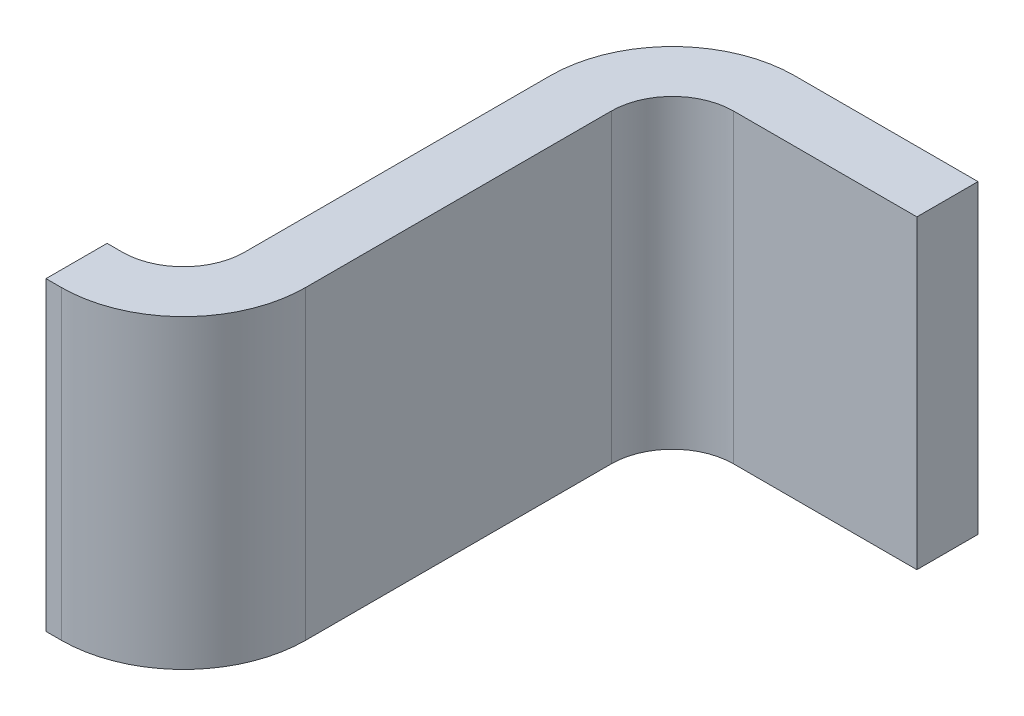
ISO-10303-21;
HEADER;
FILE_DESCRIPTION(('STEP AP214'),'2;1');
FILE_NAME('part.step','',(''),(''),'','','');
FILE_SCHEMA(('AUTOMOTIVE_DESIGN { 1 0 10303 214 1 1 1 1 }'));
ENDSEC;
DATA;
#1=APPLICATION_CONTEXT('core data for automotive mechanical design processes');
#2=APPLICATION_PROTOCOL_DEFINITION('international standard','automotive_design',2000,#1);
#3=PRODUCT_CONTEXT('',#1,'mechanical');
#4=PRODUCT('Part','Part','',(#3));
#5=PRODUCT_RELATED_PRODUCT_CATEGORY('part','',(#4));
#6=PRODUCT_DEFINITION_FORMATION('','',#4);
#7=PRODUCT_DEFINITION_CONTEXT('part definition',#1,'design');
#8=PRODUCT_DEFINITION('design','',#6,#7);
#9=PRODUCT_DEFINITION_SHAPE('','',#8);
#10=(LENGTH_UNIT() NAMED_UNIT(*) SI_UNIT(.MILLI.,.METRE.));
#11=(NAMED_UNIT(*) PLANE_ANGLE_UNIT() SI_UNIT($,.RADIAN.));
#12=(NAMED_UNIT(*) SI_UNIT($,.STERADIAN.) SOLID_ANGLE_UNIT());
#13=UNCERTAINTY_MEASURE_WITH_UNIT(LENGTH_MEASURE(1.E-05),#10,'distance_accuracy_value','');
#14=(GEOMETRIC_REPRESENTATION_CONTEXT(3) GLOBAL_UNCERTAINTY_ASSIGNED_CONTEXT((#13)) GLOBAL_UNIT_ASSIGNED_CONTEXT((#10,
#11,#12)) REPRESENTATION_CONTEXT('',''));
#15=CARTESIAN_POINT('',(0.,0.,0.));
#16=DIRECTION('',(0.,0.,1.));
#17=DIRECTION('',(1.,0.,0.));
#18=AXIS2_PLACEMENT_3D('',#15,#16,#17);
#19=CARTESIAN_POINT('',(0.,0.25,0.9));
#20=DIRECTION('',(0.,0.,-1.));
#21=DIRECTION('',(-1.,0.,0.));
#22=AXIS2_PLACEMENT_3D('',#19,#20,#21);
#23=PLANE('',#22);
#24=DIRECTION('',(1.,0.,0.));
#25=VECTOR('',#24,1.);
#26=CARTESIAN_POINT('',(0.,0.25,0.9));
#27=LINE('',#26,#25);
#28=CARTESIAN_POINT('',(0.025,0.25,0.9));
#29=VERTEX_POINT('',#28);
#30=CARTESIAN_POINT('',(0.,0.25,0.9));
#31=VERTEX_POINT('',#30);
#32=EDGE_CURVE('E85',#29,#31,#27,.F.);
#33=ORIENTED_EDGE('',*,*,#32,.T.);
#34=DIRECTION('',(0.,1.,0.));
#35=VECTOR('',#34,1.);
#36=CARTESIAN_POINT('',(0.,-0.25,0.9));
#37=LINE('',#36,#35);
#38=CARTESIAN_POINT('',(0.,-0.25,0.9));
#39=VERTEX_POINT('',#38);
#40=EDGE_CURVE('E111',#39,#31,#37,.T.);
#41=ORIENTED_EDGE('',*,*,#40,.F.);
#42=DIRECTION('',(1.,0.,0.));
#43=VECTOR('',#42,1.);
#44=CARTESIAN_POINT('',(0.,-0.25,0.9));
#45=LINE('',#44,#43);
#46=CARTESIAN_POINT('',(0.025,-0.25,0.9));
#47=VERTEX_POINT('',#46);
#48=EDGE_CURVE('E130',#39,#47,#45,.T.);
#49=ORIENTED_EDGE('',*,*,#48,.T.);
#50=DIRECTION('',(0.,1.,0.));
#51=VECTOR('',#50,1.);
#52=CARTESIAN_POINT('',(0.025,0.25,0.9));
#53=LINE('',#52,#51);
#54=EDGE_CURVE('E121',#29,#47,#53,.F.);
#55=ORIENTED_EDGE('',*,*,#54,.F.);
#56=EDGE_LOOP('',(#33,#41,#49,#55));
#57=FACE_BOUND('',#56,.T.);
#58=ADVANCED_FACE('F17',(#57),#23,.F.);
#59=CARTESIAN_POINT('',(0.325,0.25,0.1));
#60=DIRECTION('',(0.,0.,-1.));
#61=DIRECTION('',(-1.,0.,0.));
#62=AXIS2_PLACEMENT_3D('',#59,#60,#61);
#63=PLANE('',#62);
#64=DIRECTION('',(1.,0.,0.));
#65=VECTOR('',#64,1.);
#66=CARTESIAN_POINT('',(0.325,0.25,0.1));
#67=LINE('',#66,#65);
#68=CARTESIAN_POINT('',(0.625,0.25,0.1));
#69=VERTEX_POINT('',#68);
#70=CARTESIAN_POINT('',(0.325,0.25,0.1));
#71=VERTEX_POINT('',#70);
#72=EDGE_CURVE('E142',#69,#71,#67,.F.);
#73=ORIENTED_EDGE('',*,*,#72,.T.);
#74=DIRECTION('',(0.,-1.,0.));
#75=VECTOR('',#74,1.);
#76=CARTESIAN_POINT('',(0.325,0.25,0.1));
#77=LINE('',#76,#75);
#78=CARTESIAN_POINT('',(0.325,-0.25,0.1));
#79=VERTEX_POINT('',#78);
#80=EDGE_CURVE('E189',#71,#79,#77,.T.);
#81=ORIENTED_EDGE('',*,*,#80,.T.);
#82=DIRECTION('',(1.,0.,0.));
#83=VECTOR('',#82,1.);
#84=CARTESIAN_POINT('',(0.325,-0.25,0.1));
#85=LINE('',#84,#83);
#86=CARTESIAN_POINT('',(0.625,-0.25,0.1));
#87=VERTEX_POINT('',#86);
#88=EDGE_CURVE('E193',#79,#87,#85,.T.);
#89=ORIENTED_EDGE('',*,*,#88,.T.);
#90=DIRECTION('',(0.,1.,0.));
#91=VECTOR('',#90,1.);
#92=CARTESIAN_POINT('',(0.625,-0.25,0.1));
#93=LINE('',#92,#91);
#94=EDGE_CURVE('E96',#87,#69,#93,.T.);
#95=ORIENTED_EDGE('',*,*,#94,.T.);
#96=EDGE_LOOP('',(#73,#81,#89,#95));
#97=FACE_BOUND('',#96,.T.);
#98=ADVANCED_FACE('F230',(#97),#63,.F.);
#99=CARTESIAN_POINT('',(0.,-0.25,0.8));
#100=DIRECTION('',(-1.,0.,0.));
#101=DIRECTION('',(0.,0.,1.));
#102=AXIS2_PLACEMENT_3D('',#99,#100,#101);
#103=PLANE('',#102);
#104=DIRECTION('',(0.,0.,1.));
#105=VECTOR('',#104,1.);
#106=CARTESIAN_POINT('',(0.,0.25,0.8));
#107=LINE('',#106,#105);
#108=CARTESIAN_POINT('',(0.,0.25,0.8));
#109=VERTEX_POINT('',#108);
#110=EDGE_CURVE('E114',#31,#109,#107,.F.);
#111=ORIENTED_EDGE('',*,*,#110,.T.);
#112=DIRECTION('',(0.,1.,0.));
#113=VECTOR('',#112,1.);
#114=CARTESIAN_POINT('',(0.,-0.25,0.8));
#115=LINE('',#114,#113);
#116=CARTESIAN_POINT('',(0.,-0.25,0.8));
#117=VERTEX_POINT('',#116);
#118=EDGE_CURVE('E175',#109,#117,#115,.F.);
#119=ORIENTED_EDGE('',*,*,#118,.T.);
#120=DIRECTION('',(0.,0.,1.));
#121=VECTOR('',#120,1.);
#122=CARTESIAN_POINT('',(0.,-0.25,0.9));
#123=LINE('',#122,#121);
#124=EDGE_CURVE('E116',#117,#39,#123,.T.);
#125=ORIENTED_EDGE('',*,*,#124,.T.);
#126=ORIENTED_EDGE('',*,*,#40,.T.);
#127=EDGE_LOOP('',(#111,#119,#125,#126));
#128=FACE_BOUND('',#127,.T.);
#129=ADVANCED_FACE('F112',(#128),#103,.T.);
#130=CARTESIAN_POINT('',(0.025,0.25,0.7));
#131=DIRECTION('',(0.,1.,0.));
#132=DIRECTION('',(0.,0.,1.));
#133=AXIS2_PLACEMENT_3D('',#130,#131,#132);
#134=CYLINDRICAL_SURFACE('',#133,0.2);
#135=CARTESIAN_POINT('',(0.025,0.25,0.7));
#136=DIRECTION('',(0.,1.,0.));
#137=DIRECTION('',(0.,0.,1.));
#138=AXIS2_PLACEMENT_3D('',#135,#136,#137);
#139=CIRCLE('',#138,0.2);
#140=CARTESIAN_POINT('',(0.225,0.25,0.7));
#141=VERTEX_POINT('',#140);
#142=EDGE_CURVE('E20',#29,#141,#139,.T.);
#143=ORIENTED_EDGE('',*,*,#142,.F.);
#144=ORIENTED_EDGE('',*,*,#54,.T.);
#145=CARTESIAN_POINT('',(0.025,-0.25,0.7));
#146=DIRECTION('',(0.,1.,0.));
#147=DIRECTION('',(0.,0.,1.));
#148=AXIS2_PLACEMENT_3D('',#145,#146,#147);
#149=CIRCLE('',#148,0.2);
#150=CARTESIAN_POINT('',(0.225,-0.25,0.7));
#151=VERTEX_POINT('',#150);
#152=EDGE_CURVE('E166',#151,#47,#149,.F.);
#153=ORIENTED_EDGE('',*,*,#152,.F.);
#154=DIRECTION('',(0.,1.,0.));
#155=VECTOR('',#154,1.);
#156=CARTESIAN_POINT('',(0.225,0.25,0.7));
#157=LINE('',#156,#155);
#158=EDGE_CURVE('E168',#151,#141,#157,.T.);
#159=ORIENTED_EDGE('',*,*,#158,.T.);
#160=EDGE_LOOP('',(#143,#144,#153,#159));
#161=FACE_BOUND('',#160,.T.);
#162=ADVANCED_FACE('F220',(#161),#134,.T.);
#163=CARTESIAN_POINT('',(0.625,-0.25,0.));
#164=DIRECTION('',(-1.,0.,0.));
#165=DIRECTION('',(0.,0.,1.));
#166=AXIS2_PLACEMENT_3D('',#163,#164,#165);
#167=PLANE('',#166);
#168=DIRECTION('',(0.,0.,1.));
#169=VECTOR('',#168,1.);
#170=CARTESIAN_POINT('',(0.625,0.25,0.));
#171=LINE('',#170,#169);
#172=CARTESIAN_POINT('',(0.625,0.25,0.));
#173=VERTEX_POINT('',#172);
#174=EDGE_CURVE('E141',#69,#173,#171,.F.);
#175=ORIENTED_EDGE('',*,*,#174,.F.);
#176=ORIENTED_EDGE('',*,*,#94,.F.);
#177=DIRECTION('',(0.,0.,1.));
#178=VECTOR('',#177,1.);
#179=CARTESIAN_POINT('',(0.625,-0.25,0.1));
#180=LINE('',#179,#178);
#181=CARTESIAN_POINT('',(0.625,-0.25,0.));
#182=VERTEX_POINT('',#181);
#183=EDGE_CURVE('E192',#87,#182,#180,.F.);
#184=ORIENTED_EDGE('',*,*,#183,.T.);
#185=DIRECTION('',(0.,1.,0.));
#186=VECTOR('',#185,1.);
#187=CARTESIAN_POINT('',(0.625,-0.25,0.));
#188=LINE('',#187,#186);
#189=EDGE_CURVE('E161',#182,#173,#188,.T.);
#190=ORIENTED_EDGE('',*,*,#189,.T.);
#191=EDGE_LOOP('',(#175,#176,#184,#190));
#192=FACE_BOUND('',#191,.T.);
#193=ADVANCED_FACE('F232',(#192),#167,.F.);
#194=CARTESIAN_POINT('',(0.325,0.25,0.2));
#195=DIRECTION('',(0.,-1.,0.));
#196=DIRECTION('',(0.,0.,-1.));
#197=AXIS2_PLACEMENT_3D('',#194,#195,#196);
#198=CYLINDRICAL_SURFACE('',#197,0.1);
#199=CARTESIAN_POINT('',(0.325,0.25,0.2));
#200=DIRECTION('',(0.,-1.,0.));
#201=DIRECTION('',(0.,0.,-1.));
#202=AXIS2_PLACEMENT_3D('',#199,#200,#201);
#203=CIRCLE('',#202,0.1);
#204=CARTESIAN_POINT('',(0.225,0.25,0.2));
#205=VERTEX_POINT('',#204);
#206=EDGE_CURVE('E162',#205,#71,#203,.T.);
#207=ORIENTED_EDGE('',*,*,#206,.F.);
#208=DIRECTION('',(0.,1.,0.));
#209=VECTOR('',#208,1.);
#210=CARTESIAN_POINT('',(0.225,0.25,0.2));
#211=LINE('',#210,#209);
#212=CARTESIAN_POINT('',(0.225,-0.25,0.2));
#213=VERTEX_POINT('',#212);
#214=EDGE_CURVE('E165',#205,#213,#211,.F.);
#215=ORIENTED_EDGE('',*,*,#214,.T.);
#216=CARTESIAN_POINT('',(0.325,-0.25,0.2));
#217=DIRECTION('',(0.,-1.,0.));
#218=DIRECTION('',(0.,0.,-1.));
#219=AXIS2_PLACEMENT_3D('',#216,#217,#218);
#220=CIRCLE('',#219,0.1);
#221=EDGE_CURVE('E159',#79,#213,#220,.F.);
#222=ORIENTED_EDGE('',*,*,#221,.F.);
#223=ORIENTED_EDGE('',*,*,#80,.F.);
#224=EDGE_LOOP('',(#207,#215,#222,#223));
#225=FACE_BOUND('',#224,.T.);
#226=ADVANCED_FACE('F226',(#225),#198,.F.);
#227=CARTESIAN_POINT('',(0.,-0.25,0.8));
#228=DIRECTION('',(0.,0.,1.));
#229=DIRECTION('',(1.,0.,0.));
#230=AXIS2_PLACEMENT_3D('',#227,#228,#229);
#231=PLANE('',#230);
#232=DIRECTION('',(1.,0.,0.));
#233=VECTOR('',#232,1.);
#234=CARTESIAN_POINT('',(0.,-0.25,0.8));
#235=LINE('',#234,#233);
#236=CARTESIAN_POINT('',(0.025,-0.25,0.8));
#237=VERTEX_POINT('',#236);
#238=EDGE_CURVE('E169',#117,#237,#235,.T.);
#239=ORIENTED_EDGE('',*,*,#238,.F.);
#240=ORIENTED_EDGE('',*,*,#118,.F.);
#241=DIRECTION('',(1.,0.,0.));
#242=VECTOR('',#241,1.);
#243=CARTESIAN_POINT('',(0.,0.25,0.8));
#244=LINE('',#243,#242);
#245=CARTESIAN_POINT('',(0.025,0.25,0.8));
#246=VERTEX_POINT('',#245);
#247=EDGE_CURVE('E128',#246,#109,#244,.F.);
#248=ORIENTED_EDGE('',*,*,#247,.F.);
#249=DIRECTION('',(0.,1.,0.));
#250=VECTOR('',#249,1.);
#251=CARTESIAN_POINT('',(0.025,-0.25,0.8));
#252=LINE('',#251,#250);
#253=EDGE_CURVE('E155',#246,#237,#252,.F.);
#254=ORIENTED_EDGE('',*,*,#253,.T.);
#255=EDGE_LOOP('',(#239,#240,#248,#254));
#256=FACE_BOUND('',#255,.T.);
#257=ADVANCED_FACE('F266',(#256),#231,.F.);
#258=CARTESIAN_POINT('',(0.225,0.25,0.7));
#259=DIRECTION('',(-1.,0.,0.));
#260=DIRECTION('',(0.,0.,1.));
#261=AXIS2_PLACEMENT_3D('',#258,#259,#260);
#262=PLANE('',#261);
#263=DIRECTION('',(0.,0.,-1.));
#264=VECTOR('',#263,1.);
#265=CARTESIAN_POINT('',(0.225,0.25,0.7));
#266=LINE('',#265,#264);
#267=EDGE_CURVE('E158',#205,#141,#266,.F.);
#268=ORIENTED_EDGE('',*,*,#267,.T.);
#269=ORIENTED_EDGE('',*,*,#158,.F.);
#270=DIRECTION('',(0.,0.,1.));
#271=VECTOR('',#270,1.);
#272=CARTESIAN_POINT('',(0.225,-0.25,0.7));
#273=LINE('',#272,#271);
#274=EDGE_CURVE('E152',#151,#213,#273,.F.);
#275=ORIENTED_EDGE('',*,*,#274,.T.);
#276=ORIENTED_EDGE('',*,*,#214,.F.);
#277=EDGE_LOOP('',(#268,#269,#275,#276));
#278=FACE_BOUND('',#277,.T.);
#279=ADVANCED_FACE('F268',(#278),#262,.F.);
#280=CARTESIAN_POINT('',(0.325,-0.25,0.));
#281=DIRECTION('',(0.,0.,1.));
#282=DIRECTION('',(1.,0.,0.));
#283=AXIS2_PLACEMENT_3D('',#280,#281,#282);
#284=PLANE('',#283);
#285=DIRECTION('',(1.,0.,0.));
#286=VECTOR('',#285,1.);
#287=CARTESIAN_POINT('',(0.325,-0.25,0.));
#288=LINE('',#287,#286);
#289=CARTESIAN_POINT('',(0.325,-0.25,0.));
#290=VERTEX_POINT('',#289);
#291=EDGE_CURVE('E203',#290,#182,#288,.T.);
#292=ORIENTED_EDGE('',*,*,#291,.F.);
#293=DIRECTION('',(0.,-1.,0.));
#294=VECTOR('',#293,1.);
#295=CARTESIAN_POINT('',(0.325,-0.25,0.));
#296=LINE('',#295,#294);
#297=CARTESIAN_POINT('',(0.325,0.25,0.));
#298=VERTEX_POINT('',#297);
#299=EDGE_CURVE('E149',#298,#290,#296,.T.);
#300=ORIENTED_EDGE('',*,*,#299,.F.);
#301=DIRECTION('',(1.,0.,0.));
#302=VECTOR('',#301,1.);
#303=CARTESIAN_POINT('',(0.325,0.25,0.));
#304=LINE('',#303,#302);
#305=EDGE_CURVE('E164',#173,#298,#304,.F.);
#306=ORIENTED_EDGE('',*,*,#305,.F.);
#307=ORIENTED_EDGE('',*,*,#189,.F.);
#308=EDGE_LOOP('',(#292,#300,#306,#307));
#309=FACE_BOUND('',#308,.T.);
#310=ADVANCED_FACE('F238',(#309),#284,.F.);
#311=CARTESIAN_POINT('',(0.125,0.25,0.7));
#312=DIRECTION('',(0.,-1.,0.));
#313=DIRECTION('',(0.,0.,-1.));
#314=AXIS2_PLACEMENT_3D('',#311,#312,#313);
#315=PLANE('',#314);
#316=DIRECTION('',(0.,0.,-1.));
#317=VECTOR('',#316,1.);
#318=CARTESIAN_POINT('',(0.125,0.25,0.7));
#319=LINE('',#318,#317);
#320=CARTESIAN_POINT('',(0.125,0.25,0.2));
#321=VERTEX_POINT('',#320);
#322=CARTESIAN_POINT('',(0.125,0.25,0.7));
#323=VERTEX_POINT('',#322);
#324=EDGE_CURVE('E148',#321,#323,#319,.F.);
#325=ORIENTED_EDGE('',*,*,#324,.T.);
#326=CARTESIAN_POINT('',(0.025,0.25,0.7));
#327=DIRECTION('',(0.,1.,0.));
#328=DIRECTION('',(0.,0.,1.));
#329=AXIS2_PLACEMENT_3D('',#326,#327,#328);
#330=CIRCLE('',#329,0.1);
#331=EDGE_CURVE('E156',#323,#246,#330,.F.);
#332=ORIENTED_EDGE('',*,*,#331,.T.);
#333=ORIENTED_EDGE('',*,*,#247,.T.);
#334=ORIENTED_EDGE('',*,*,#110,.F.);
#335=ORIENTED_EDGE('',*,*,#32,.F.);
#336=ORIENTED_EDGE('',*,*,#142,.T.);
#337=ORIENTED_EDGE('',*,*,#267,.F.);
#338=ORIENTED_EDGE('',*,*,#206,.T.);
#339=ORIENTED_EDGE('',*,*,#72,.F.);
#340=ORIENTED_EDGE('',*,*,#174,.T.);
#341=ORIENTED_EDGE('',*,*,#305,.T.);
#342=CARTESIAN_POINT('',(0.325,0.25,0.2));
#343=DIRECTION('',(0.,-1.,0.));
#344=DIRECTION('',(0.,0.,-1.));
#345=AXIS2_PLACEMENT_3D('',#342,#343,#344);
#346=CIRCLE('',#345,0.2);
#347=EDGE_CURVE('E150',#321,#298,#346,.T.);
#348=ORIENTED_EDGE('',*,*,#347,.F.);
#349=EDGE_LOOP('',(#325,#332,#333,#334,#335,#336,#337,#338,#339,#340,#341,#348));
#350=FACE_BOUND('',#349,.T.);
#351=ADVANCED_FACE('F126',(#350),#315,.F.);
#352=CARTESIAN_POINT('',(0.025,-0.25,0.7));
#353=DIRECTION('',(0.,1.,0.));
#354=DIRECTION('',(0.,0.,1.));
#355=AXIS2_PLACEMENT_3D('',#352,#353,#354);
#356=CYLINDRICAL_SURFACE('',#355,0.1);
#357=CARTESIAN_POINT('',(0.025,-0.25,0.7));
#358=DIRECTION('',(0.,1.,0.));
#359=DIRECTION('',(0.,0.,1.));
#360=AXIS2_PLACEMENT_3D('',#357,#358,#359);
#361=CIRCLE('',#360,0.1);
#362=CARTESIAN_POINT('',(0.125,-0.25,0.7));
#363=VERTEX_POINT('',#362);
#364=EDGE_CURVE('E153',#237,#363,#361,.T.);
#365=ORIENTED_EDGE('',*,*,#364,.F.);
#366=ORIENTED_EDGE('',*,*,#253,.F.);
#367=ORIENTED_EDGE('',*,*,#331,.F.);
#368=DIRECTION('',(0.,1.,0.));
#369=VECTOR('',#368,1.);
#370=CARTESIAN_POINT('',(0.125,-0.25,0.7));
#371=LINE('',#370,#369);
#372=EDGE_CURVE('E251',#323,#363,#371,.F.);
#373=ORIENTED_EDGE('',*,*,#372,.T.);
#374=EDGE_LOOP('',(#365,#366,#367,#373));
#375=FACE_BOUND('',#374,.T.);
#376=ADVANCED_FACE('F263',(#375),#356,.F.);
#377=CARTESIAN_POINT('',(0.225,-0.25,0.7));
#378=DIRECTION('',(0.,1.,0.));
#379=DIRECTION('',(0.,0.,1.));
#380=AXIS2_PLACEMENT_3D('',#377,#378,#379);
#381=PLANE('',#380);
#382=ORIENTED_EDGE('',*,*,#274,.F.);
#383=ORIENTED_EDGE('',*,*,#152,.T.);
#384=ORIENTED_EDGE('',*,*,#48,.F.);
#385=ORIENTED_EDGE('',*,*,#124,.F.);
#386=ORIENTED_EDGE('',*,*,#238,.T.);
#387=ORIENTED_EDGE('',*,*,#364,.T.);
#388=DIRECTION('',(0.,0.,-1.));
#389=VECTOR('',#388,1.);
#390=CARTESIAN_POINT('',(0.125,-0.25,0.7));
#391=LINE('',#390,#389);
#392=CARTESIAN_POINT('',(0.125,-0.25,0.2));
#393=VERTEX_POINT('',#392);
#394=EDGE_CURVE('E26',#363,#393,#391,.T.);
#395=ORIENTED_EDGE('',*,*,#394,.T.);
#396=CARTESIAN_POINT('',(0.325,-0.25,0.2));
#397=DIRECTION('',(0.,-1.,0.));
#398=DIRECTION('',(0.,0.,-1.));
#399=AXIS2_PLACEMENT_3D('',#396,#397,#398);
#400=CIRCLE('',#399,0.2);
#401=EDGE_CURVE('E34',#290,#393,#400,.F.);
#402=ORIENTED_EDGE('',*,*,#401,.F.);
#403=ORIENTED_EDGE('',*,*,#291,.T.);
#404=ORIENTED_EDGE('',*,*,#183,.F.);
#405=ORIENTED_EDGE('',*,*,#88,.F.);
#406=ORIENTED_EDGE('',*,*,#221,.T.);
#407=EDGE_LOOP('',(#382,#383,#384,#385,#386,#387,#395,#402,#403,#404,#405,#406));
#408=FACE_BOUND('',#407,.T.);
#409=ADVANCED_FACE('F240',(#408),#381,.F.);
#410=CARTESIAN_POINT('',(0.325,-0.25,0.2));
#411=DIRECTION('',(0.,-1.,0.));
#412=DIRECTION('',(0.,0.,-1.));
#413=AXIS2_PLACEMENT_3D('',#410,#411,#412);
#414=CYLINDRICAL_SURFACE('',#413,0.2);
#415=ORIENTED_EDGE('',*,*,#401,.T.);
#416=DIRECTION('',(0.,1.,0.));
#417=VECTOR('',#416,1.);
#418=CARTESIAN_POINT('',(0.125,-0.25,0.2));
#419=LINE('',#418,#417);
#420=EDGE_CURVE('E11',#393,#321,#419,.T.);
#421=ORIENTED_EDGE('',*,*,#420,.T.);
#422=ORIENTED_EDGE('',*,*,#347,.T.);
#423=ORIENTED_EDGE('',*,*,#299,.T.);
#424=EDGE_LOOP('',(#415,#421,#422,#423));
#425=FACE_BOUND('',#424,.T.);
#426=ADVANCED_FACE('F260',(#425),#414,.T.);
#427=CARTESIAN_POINT('',(0.125,-0.25,0.7));
#428=DIRECTION('',(1.,0.,0.));
#429=DIRECTION('',(0.,0.,-1.));
#430=AXIS2_PLACEMENT_3D('',#427,#428,#429);
#431=PLANE('',#430);
#432=ORIENTED_EDGE('',*,*,#394,.F.);
#433=ORIENTED_EDGE('',*,*,#372,.F.);
#434=ORIENTED_EDGE('',*,*,#324,.F.);
#435=ORIENTED_EDGE('',*,*,#420,.F.);
#436=EDGE_LOOP('',(#432,#433,#434,#435));
#437=FACE_BOUND('',#436,.T.);
#438=ADVANCED_FACE('F258',(#437),#431,.F.);
#439=CLOSED_SHELL('',(#58,#98,#129,#162,#193,#226,#257,#279,#310,#351,#376,#409,#426,#438));
#440=MANIFOLD_SOLID_BREP('B1',#439);
#441=ADVANCED_BREP_SHAPE_REPRESENTATION('',(#18,#440),#14);
#442=SHAPE_DEFINITION_REPRESENTATION(#9,#441);
ENDSEC;
END-ISO-10303-21;
